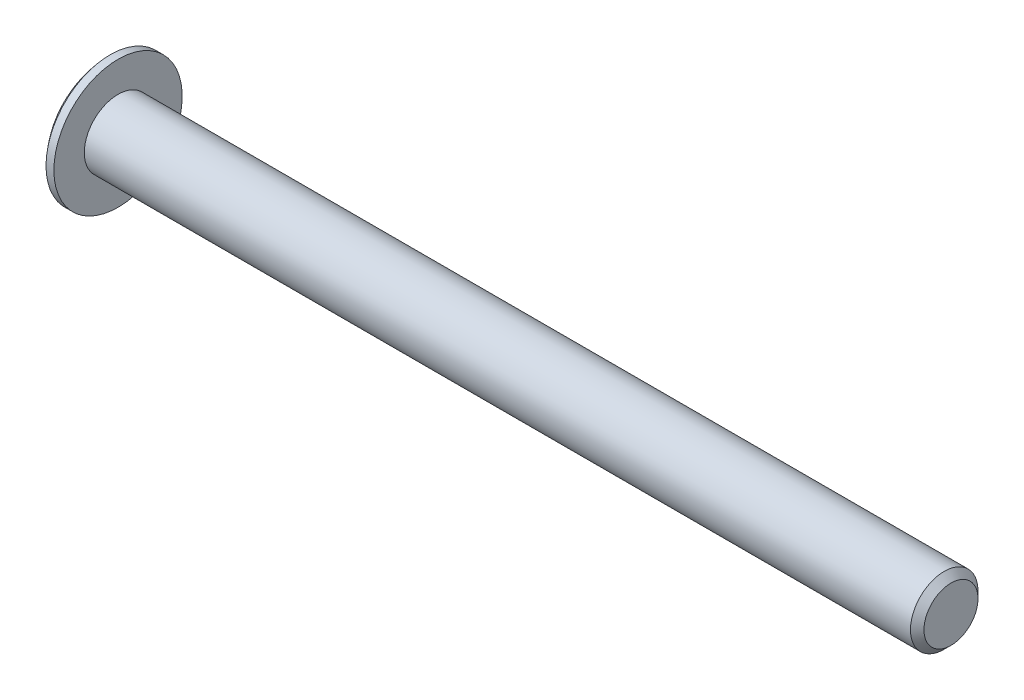
ISO-10303-21;
HEADER;
FILE_DESCRIPTION(('STEP AP214'),'2;1');
FILE_NAME('part.step','',(''),(''),'','','');
FILE_SCHEMA(('AUTOMOTIVE_DESIGN { 1 0 10303 214 1 1 1 1 }'));
ENDSEC;
DATA;
#1=APPLICATION_CONTEXT('core data for automotive mechanical design processes');
#2=APPLICATION_PROTOCOL_DEFINITION('international standard','automotive_design',2000,#1);
#3=PRODUCT_CONTEXT('',#1,'mechanical');
#4=PRODUCT('Part','Part','',(#3));
#5=PRODUCT_RELATED_PRODUCT_CATEGORY('part','',(#4));
#6=PRODUCT_DEFINITION_FORMATION('','',#4);
#7=PRODUCT_DEFINITION_CONTEXT('part definition',#1,'design');
#8=PRODUCT_DEFINITION('design','',#6,#7);
#9=PRODUCT_DEFINITION_SHAPE('','',#8);
#10=(LENGTH_UNIT() NAMED_UNIT(*) SI_UNIT(.MILLI.,.METRE.));
#11=(NAMED_UNIT(*) PLANE_ANGLE_UNIT() SI_UNIT($,.RADIAN.));
#12=(NAMED_UNIT(*) SI_UNIT($,.STERADIAN.) SOLID_ANGLE_UNIT());
#13=UNCERTAINTY_MEASURE_WITH_UNIT(LENGTH_MEASURE(1.E-05),#10,'distance_accuracy_value','');
#14=(GEOMETRIC_REPRESENTATION_CONTEXT(3) GLOBAL_UNCERTAINTY_ASSIGNED_CONTEXT((#13)) GLOBAL_UNIT_ASSIGNED_CONTEXT((#10,
#11,#12)) REPRESENTATION_CONTEXT('',''));
#15=CARTESIAN_POINT('',(0.,0.,0.));
#16=DIRECTION('',(0.,0.,1.));
#17=DIRECTION('',(1.,0.,0.));
#18=AXIS2_PLACEMENT_3D('',#15,#16,#17);
#19=CARTESIAN_POINT('',(0.,0.,0.));
#20=DIRECTION('',(1.,0.,0.));
#21=DIRECTION('',(0.,0.,-1.));
#22=AXIS2_PLACEMENT_3D('',#19,#20,#21);
#23=PLANE('',#22);
#24=DIRECTION('',(0.,-0.5,-0.866025403784439));
#25=VECTOR('',#24,1.);
#26=CARTESIAN_POINT('',(0.,2.3094010767585,0.));
#27=LINE('',#26,#25);
#28=CARTESIAN_POINT('',(0.,2.3094010767585,0.));
#29=VERTEX_POINT('',#28);
#30=CARTESIAN_POINT('',(0.,1.15470053837925,-2.));
#31=VERTEX_POINT('',#30);
#32=EDGE_CURVE('E128',#29,#31,#27,.T.);
#33=ORIENTED_EDGE('',*,*,#32,.F.);
#34=DIRECTION('',(0.,0.5,-0.866025403784438));
#35=VECTOR('',#34,1.);
#36=CARTESIAN_POINT('',(0.,1.15470053837925,2.));
#37=LINE('',#36,#35);
#38=CARTESIAN_POINT('',(0.,1.15470053837925,2.));
#39=VERTEX_POINT('',#38);
#40=EDGE_CURVE('E54',#39,#29,#37,.T.);
#41=ORIENTED_EDGE('',*,*,#40,.F.);
#42=DIRECTION('',(0.,1.,0.));
#43=VECTOR('',#42,1.);
#44=CARTESIAN_POINT('',(0.,-1.15470053837925,2.));
#45=LINE('',#44,#43);
#46=CARTESIAN_POINT('',(0.,-1.15470053837925,2.));
#47=VERTEX_POINT('',#46);
#48=EDGE_CURVE('E137',#47,#39,#45,.T.);
#49=ORIENTED_EDGE('',*,*,#48,.F.);
#50=DIRECTION('',(0.,0.5,0.866025403784439));
#51=VECTOR('',#50,1.);
#52=CARTESIAN_POINT('',(0.,-2.3094010767585,0.));
#53=LINE('',#52,#51);
#54=CARTESIAN_POINT('',(0.,-2.3094010767585,0.));
#55=VERTEX_POINT('',#54);
#56=EDGE_CURVE('E135',#55,#47,#53,.T.);
#57=ORIENTED_EDGE('',*,*,#56,.F.);
#58=DIRECTION('',(0.,-0.5,0.866025403784439));
#59=VECTOR('',#58,1.);
#60=CARTESIAN_POINT('',(0.,-1.15470053837925,-2.));
#61=LINE('',#60,#59);
#62=CARTESIAN_POINT('',(0.,-1.15470053837925,-2.));
#63=VERTEX_POINT('',#62);
#64=EDGE_CURVE('E102',#63,#55,#61,.T.);
#65=ORIENTED_EDGE('',*,*,#64,.F.);
#66=DIRECTION('',(0.,-1.,0.));
#67=VECTOR('',#66,1.);
#68=CARTESIAN_POINT('',(0.,1.15470053837925,-2.));
#69=LINE('',#68,#67);
#70=EDGE_CURVE('E131',#31,#63,#69,.T.);
#71=ORIENTED_EDGE('',*,*,#70,.F.);
#72=EDGE_LOOP('',(#33,#41,#49,#57,#65,#71));
#73=FACE_BOUND('',#72,.T.);
#74=CARTESIAN_POINT('',(0.,0.,0.));
#75=DIRECTION('',(-1.,0.,0.));
#76=DIRECTION('',(0.,0.,1.));
#77=AXIS2_PLACEMENT_3D('',#74,#75,#76);
#78=CIRCLE('',#77,2.86);
#79=CARTESIAN_POINT('',(0.,0.,2.86));
#80=VERTEX_POINT('',#79);
#81=EDGE_CURVE('E155',#80,#80,#78,.T.);
#82=ORIENTED_EDGE('',*,*,#81,.T.);
#83=EDGE_LOOP('',(#82));
#84=FACE_BOUND('',#83,.T.);
#85=ADVANCED_FACE('F38',(#73,#84),#23,.F.);
#86=CARTESIAN_POINT('',(6.73111701230913,0.,0.));
#87=DIRECTION('',(-1.,0.,0.));
#88=DIRECTION('',(0.,0.,1.));
#89=AXIS2_PLACEMENT_3D('',#86,#87,#88);
#90=DEGENERATE_TOROIDAL_SURFACE('',#89,0.938525626868098,7.,.T.);
#91=ORIENTED_EDGE('',*,*,#81,.F.);
#92=EDGE_LOOP('',(#91));
#93=FACE_BOUND('',#92,.T.);
#94=CARTESIAN_POINT('',(1.6,0.,0.));
#95=DIRECTION('',(-1.,0.,0.));
#96=DIRECTION('',(0.,0.,1.));
#97=AXIS2_PLACEMENT_3D('',#94,#95,#96);
#98=CIRCLE('',#97,5.7);
#99=CARTESIAN_POINT('',(1.6,0.,5.7));
#100=VERTEX_POINT('',#99);
#101=EDGE_CURVE('E152',#100,#100,#98,.T.);
#102=ORIENTED_EDGE('',*,*,#101,.T.);
#103=EDGE_LOOP('',(#102));
#104=FACE_BOUND('',#103,.T.);
#105=ADVANCED_FACE('F177',(#93,#104),#90,.T.);
#106=CARTESIAN_POINT('',(0.,0.,0.));
#107=DIRECTION('',(-1.,0.,0.));
#108=DIRECTION('',(0.,0.,1.));
#109=AXIS2_PLACEMENT_3D('',#106,#107,#108);
#110=CYLINDRICAL_SURFACE('',#109,5.7);
#111=ORIENTED_EDGE('',*,*,#101,.F.);
#112=EDGE_LOOP('',(#111));
#113=FACE_BOUND('',#112,.T.);
#114=CARTESIAN_POINT('',(2.3,0.,0.));
#115=DIRECTION('',(-1.,0.,0.));
#116=DIRECTION('',(0.,0.,1.));
#117=AXIS2_PLACEMENT_3D('',#114,#115,#116);
#118=CIRCLE('',#117,5.7);
#119=CARTESIAN_POINT('',(2.3,0.,5.7));
#120=VERTEX_POINT('',#119);
#121=EDGE_CURVE('E149',#120,#120,#118,.T.);
#122=ORIENTED_EDGE('',*,*,#121,.T.);
#123=EDGE_LOOP('',(#122));
#124=FACE_BOUND('',#123,.T.);
#125=ADVANCED_FACE('F182',(#113,#124),#110,.T.);
#126=CARTESIAN_POINT('',(2.3,5.7,0.));
#127=DIRECTION('',(-1.,0.,0.));
#128=DIRECTION('',(0.,0.,1.));
#129=AXIS2_PLACEMENT_3D('',#126,#127,#128);
#130=PLANE('',#129);
#131=ORIENTED_EDGE('',*,*,#121,.F.);
#132=EDGE_LOOP('',(#131));
#133=FACE_BOUND('',#132,.T.);
#134=CARTESIAN_POINT('',(2.3,0.,0.));
#135=DIRECTION('',(-1.,0.,0.));
#136=DIRECTION('',(0.,0.,1.));
#137=AXIS2_PLACEMENT_3D('',#134,#135,#136);
#138=CIRCLE('',#137,3.);
#139=CARTESIAN_POINT('',(2.3,0.,3.));
#140=VERTEX_POINT('',#139);
#141=EDGE_CURVE('E141',#140,#140,#138,.T.);
#142=ORIENTED_EDGE('',*,*,#141,.T.);
#143=EDGE_LOOP('',(#142));
#144=FACE_BOUND('',#143,.T.);
#145=ADVANCED_FACE('F190',(#133,#144),#130,.F.);
#146=CARTESIAN_POINT('',(0.,0.,0.));
#147=DIRECTION('',(-1.,0.,0.));
#148=DIRECTION('',(0.,0.,1.));
#149=AXIS2_PLACEMENT_3D('',#146,#147,#148);
#150=CYLINDRICAL_SURFACE('',#149,3.);
#151=CARTESIAN_POINT('',(75.7,0.,0.));
#152=DIRECTION('',(-1.,0.,0.));
#153=DIRECTION('',(0.,0.,1.));
#154=AXIS2_PLACEMENT_3D('',#151,#152,#153);
#155=CIRCLE('',#154,3.);
#156=CARTESIAN_POINT('',(75.7,0.,3.));
#157=VERTEX_POINT('',#156);
#158=EDGE_CURVE('E47',#157,#157,#155,.T.);
#159=ORIENTED_EDGE('',*,*,#158,.T.);
#160=EDGE_LOOP('',(#159));
#161=FACE_BOUND('',#160,.T.);
#162=ORIENTED_EDGE('',*,*,#141,.F.);
#163=EDGE_LOOP('',(#162));
#164=FACE_BOUND('',#163,.T.);
#165=ADVANCED_FACE('F160',(#161,#164),#150,.T.);
#166=CARTESIAN_POINT('',(76.3,3.,0.));
#167=DIRECTION('',(-1.,0.,0.));
#168=DIRECTION('',(0.,0.,1.));
#169=AXIS2_PLACEMENT_3D('',#166,#167,#168);
#170=PLANE('',#169);
#171=CARTESIAN_POINT('',(76.3,0.,0.));
#172=DIRECTION('',(-1.,0.,0.));
#173=DIRECTION('',(0.,0.,1.));
#174=AXIS2_PLACEMENT_3D('',#171,#172,#173);
#175=CIRCLE('',#174,2.4);
#176=CARTESIAN_POINT('',(76.3,0.,2.4));
#177=VERTEX_POINT('',#176);
#178=EDGE_CURVE('E11',#177,#177,#175,.F.);
#179=ORIENTED_EDGE('',*,*,#178,.T.);
#180=EDGE_LOOP('',(#179));
#181=FACE_BOUND('',#180,.T.);
#182=ADVANCED_FACE('F165',(#181),#170,.F.);
#183=CARTESIAN_POINT('',(75.7,0.,0.));
#184=DIRECTION('',(-1.,0.,0.));
#185=DIRECTION('',(0.,0.,1.));
#186=AXIS2_PLACEMENT_3D('',#183,#184,#185);
#187=CONICAL_SURFACE('',#186,3.,0.785398163397435);
#188=ORIENTED_EDGE('',*,*,#178,.F.);
#189=EDGE_LOOP('',(#188));
#190=FACE_BOUND('',#189,.T.);
#191=ORIENTED_EDGE('',*,*,#158,.F.);
#192=EDGE_LOOP('',(#191));
#193=FACE_BOUND('',#192,.T.);
#194=ADVANCED_FACE('F41',(#190,#193),#187,.T.);
#195=CARTESIAN_POINT('',(2.,1.15470053837925,2.));
#196=DIRECTION('',(0.,0.866025403784438,0.5));
#197=DIRECTION('',(0.,-0.5,0.866025403784439));
#198=AXIS2_PLACEMENT_3D('',#195,#196,#197);
#199=PLANE('',#198);
#200=ORIENTED_EDGE('',*,*,#40,.T.);
#201=DIRECTION('',(-1.,0.,0.));
#202=VECTOR('',#201,1.);
#203=CARTESIAN_POINT('',(2.,2.3094010767585,0.));
#204=LINE('',#203,#202);
#205=CARTESIAN_POINT('',(2.,2.3094010767585,0.));
#206=VERTEX_POINT('',#205);
#207=EDGE_CURVE('E84',#206,#29,#204,.T.);
#208=ORIENTED_EDGE('',*,*,#207,.F.);
#209=DIRECTION('',(0.,0.5,-0.866025403784438));
#210=VECTOR('',#209,1.);
#211=CARTESIAN_POINT('',(2.,1.15470053837925,2.));
#212=LINE('',#211,#210);
#213=CARTESIAN_POINT('',(2.,1.15470053837925,2.));
#214=VERTEX_POINT('',#213);
#215=EDGE_CURVE('E139',#214,#206,#212,.T.);
#216=ORIENTED_EDGE('',*,*,#215,.F.);
#217=DIRECTION('',(-1.,0.,0.));
#218=VECTOR('',#217,1.);
#219=CARTESIAN_POINT('',(2.,1.15470053837925,2.));
#220=LINE('',#219,#218);
#221=EDGE_CURVE('E62',#214,#39,#220,.T.);
#222=ORIENTED_EDGE('',*,*,#221,.T.);
#223=EDGE_LOOP('',(#200,#208,#216,#222));
#224=FACE_BOUND('',#223,.T.);
#225=ADVANCED_FACE('F164',(#224),#199,.F.);
#226=CARTESIAN_POINT('',(2.,-1.15470053837925,2.));
#227=DIRECTION('',(0.,0.,1.));
#228=DIRECTION('',(1.,0.,0.));
#229=AXIS2_PLACEMENT_3D('',#226,#227,#228);
#230=PLANE('',#229);
#231=ORIENTED_EDGE('',*,*,#48,.T.);
#232=ORIENTED_EDGE('',*,*,#221,.F.);
#233=DIRECTION('',(0.,1.,0.));
#234=VECTOR('',#233,1.);
#235=CARTESIAN_POINT('',(2.,-1.15470053837925,2.));
#236=LINE('',#235,#234);
#237=CARTESIAN_POINT('',(2.,-1.15470053837925,2.));
#238=VERTEX_POINT('',#237);
#239=EDGE_CURVE('E114',#238,#214,#236,.T.);
#240=ORIENTED_EDGE('',*,*,#239,.F.);
#241=DIRECTION('',(-1.,0.,0.));
#242=VECTOR('',#241,1.);
#243=CARTESIAN_POINT('',(2.,-1.15470053837925,2.));
#244=LINE('',#243,#242);
#245=EDGE_CURVE('E106',#238,#47,#244,.T.);
#246=ORIENTED_EDGE('',*,*,#245,.T.);
#247=EDGE_LOOP('',(#231,#232,#240,#246));
#248=FACE_BOUND('',#247,.T.);
#249=ADVANCED_FACE('F171',(#248),#230,.F.);
#250=CARTESIAN_POINT('',(2.,-2.3094010767585,0.));
#251=DIRECTION('',(0.,-0.866025403784439,0.5));
#252=DIRECTION('',(0.,-0.5,-0.866025403784439));
#253=AXIS2_PLACEMENT_3D('',#250,#251,#252);
#254=PLANE('',#253);
#255=ORIENTED_EDGE('',*,*,#56,.T.);
#256=ORIENTED_EDGE('',*,*,#245,.F.);
#257=DIRECTION('',(0.,0.5,0.866025403784439));
#258=VECTOR('',#257,1.);
#259=CARTESIAN_POINT('',(2.,-2.3094010767585,0.));
#260=LINE('',#259,#258);
#261=CARTESIAN_POINT('',(2.,-2.3094010767585,0.));
#262=VERTEX_POINT('',#261);
#263=EDGE_CURVE('E110',#262,#238,#260,.T.);
#264=ORIENTED_EDGE('',*,*,#263,.F.);
#265=DIRECTION('',(-1.,0.,0.));
#266=VECTOR('',#265,1.);
#267=CARTESIAN_POINT('',(2.,-2.3094010767585,0.));
#268=LINE('',#267,#266);
#269=EDGE_CURVE('E95',#262,#55,#268,.T.);
#270=ORIENTED_EDGE('',*,*,#269,.T.);
#271=EDGE_LOOP('',(#255,#256,#264,#270));
#272=FACE_BOUND('',#271,.T.);
#273=ADVANCED_FACE('F111',(#272),#254,.F.);
#274=CARTESIAN_POINT('',(2.,-1.15470053837925,-2.));
#275=DIRECTION('',(0.,-0.866025403784439,-0.5));
#276=DIRECTION('',(0.,0.5,-0.866025403784439));
#277=AXIS2_PLACEMENT_3D('',#274,#275,#276);
#278=PLANE('',#277);
#279=ORIENTED_EDGE('',*,*,#64,.T.);
#280=ORIENTED_EDGE('',*,*,#269,.F.);
#281=DIRECTION('',(0.,-0.5,0.866025403784439));
#282=VECTOR('',#281,1.);
#283=CARTESIAN_POINT('',(2.,-1.15470053837925,-2.));
#284=LINE('',#283,#282);
#285=CARTESIAN_POINT('',(2.,-1.15470053837925,-2.));
#286=VERTEX_POINT('',#285);
#287=EDGE_CURVE('E99',#286,#262,#284,.T.);
#288=ORIENTED_EDGE('',*,*,#287,.F.);
#289=DIRECTION('',(-1.,0.,0.));
#290=VECTOR('',#289,1.);
#291=CARTESIAN_POINT('',(2.,-1.15470053837925,-2.));
#292=LINE('',#291,#290);
#293=EDGE_CURVE('E107',#286,#63,#292,.T.);
#294=ORIENTED_EDGE('',*,*,#293,.T.);
#295=EDGE_LOOP('',(#279,#280,#288,#294));
#296=FACE_BOUND('',#295,.T.);
#297=ADVANCED_FACE('F97',(#296),#278,.F.);
#298=CARTESIAN_POINT('',(2.,1.15470053837925,-2.));
#299=DIRECTION('',(0.,0.,-1.));
#300=DIRECTION('',(0.,1.,0.));
#301=AXIS2_PLACEMENT_3D('',#298,#299,#300);
#302=PLANE('',#301);
#303=ORIENTED_EDGE('',*,*,#70,.T.);
#304=ORIENTED_EDGE('',*,*,#293,.F.);
#305=DIRECTION('',(0.,-1.,0.));
#306=VECTOR('',#305,1.);
#307=CARTESIAN_POINT('',(2.,1.15470053837925,-2.));
#308=LINE('',#307,#306);
#309=CARTESIAN_POINT('',(2.,1.15470053837925,-2.));
#310=VERTEX_POINT('',#309);
#311=EDGE_CURVE('E120',#310,#286,#308,.T.);
#312=ORIENTED_EDGE('',*,*,#311,.F.);
#313=DIRECTION('',(-1.,0.,0.));
#314=VECTOR('',#313,1.);
#315=CARTESIAN_POINT('',(2.,1.15470053837925,-2.));
#316=LINE('',#315,#314);
#317=EDGE_CURVE('E144',#310,#31,#316,.T.);
#318=ORIENTED_EDGE('',*,*,#317,.T.);
#319=EDGE_LOOP('',(#303,#304,#312,#318));
#320=FACE_BOUND('',#319,.T.);
#321=ADVANCED_FACE('F200',(#320),#302,.F.);
#322=CARTESIAN_POINT('',(2.,2.3094010767585,0.));
#323=DIRECTION('',(0.,0.866025403784439,-0.5));
#324=DIRECTION('',(0.,0.5,0.866025403784439));
#325=AXIS2_PLACEMENT_3D('',#322,#323,#324);
#326=PLANE('',#325);
#327=ORIENTED_EDGE('',*,*,#32,.T.);
#328=ORIENTED_EDGE('',*,*,#317,.F.);
#329=DIRECTION('',(0.,-0.5,-0.866025403784439));
#330=VECTOR('',#329,1.);
#331=CARTESIAN_POINT('',(2.,2.3094010767585,0.));
#332=LINE('',#331,#330);
#333=EDGE_CURVE('E122',#206,#310,#332,.T.);
#334=ORIENTED_EDGE('',*,*,#333,.F.);
#335=ORIENTED_EDGE('',*,*,#207,.T.);
#336=EDGE_LOOP('',(#327,#328,#334,#335));
#337=FACE_BOUND('',#336,.T.);
#338=ADVANCED_FACE('F197',(#337),#326,.F.);
#339=CARTESIAN_POINT('',(2.,0.,0.));
#340=DIRECTION('',(-1.,0.,0.));
#341=DIRECTION('',(0.,0.,1.));
#342=AXIS2_PLACEMENT_3D('',#339,#340,#341);
#343=PLANE('',#342);
#344=ORIENTED_EDGE('',*,*,#215,.T.);
#345=ORIENTED_EDGE('',*,*,#333,.T.);
#346=ORIENTED_EDGE('',*,*,#311,.T.);
#347=ORIENTED_EDGE('',*,*,#287,.T.);
#348=ORIENTED_EDGE('',*,*,#263,.T.);
#349=ORIENTED_EDGE('',*,*,#239,.T.);
#350=EDGE_LOOP('',(#344,#345,#346,#347,#348,#349));
#351=FACE_BOUND('',#350,.T.);
#352=ADVANCED_FACE('F117',(#351),#343,.T.);
#353=CLOSED_SHELL('',(#85,#105,#125,#145,#165,#182,#194,#225,#249,#273,#297,#321,#338,#352));
#354=MANIFOLD_SOLID_BREP('B2',#353);
#355=ADVANCED_BREP_SHAPE_REPRESENTATION('',(#18,#354),#14);
#356=SHAPE_DEFINITION_REPRESENTATION(#9,#355);
ENDSEC;
END-ISO-10303-21;
